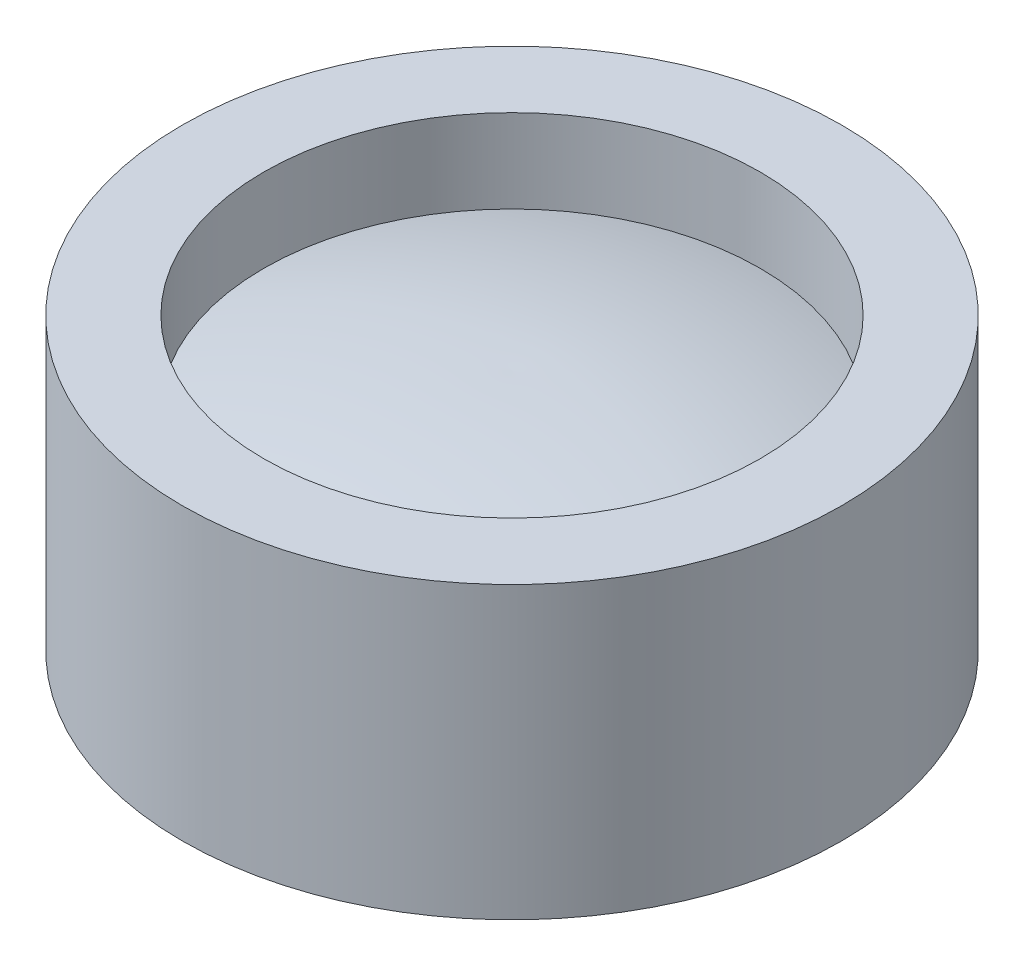
ISO-10303-21;
HEADER;
FILE_DESCRIPTION(('STEP AP214'),'2;1');
FILE_NAME('part.step','',(''),(''),'','','');
FILE_SCHEMA(('AUTOMOTIVE_DESIGN { 1 0 10303 214 1 1 1 1 }'));
ENDSEC;
DATA;
#1=APPLICATION_CONTEXT('core data for automotive mechanical design processes');
#2=APPLICATION_PROTOCOL_DEFINITION('international standard','automotive_design',2000,#1);
#3=PRODUCT_CONTEXT('',#1,'mechanical');
#4=PRODUCT('Part','Part','',(#3));
#5=PRODUCT_RELATED_PRODUCT_CATEGORY('part','',(#4));
#6=PRODUCT_DEFINITION_FORMATION('','',#4);
#7=PRODUCT_DEFINITION_CONTEXT('part definition',#1,'design');
#8=PRODUCT_DEFINITION('design','',#6,#7);
#9=PRODUCT_DEFINITION_SHAPE('','',#8);
#10=(LENGTH_UNIT() NAMED_UNIT(*) SI_UNIT(.MILLI.,.METRE.));
#11=(NAMED_UNIT(*) PLANE_ANGLE_UNIT() SI_UNIT($,.RADIAN.));
#12=(NAMED_UNIT(*) SI_UNIT($,.STERADIAN.) SOLID_ANGLE_UNIT());
#13=UNCERTAINTY_MEASURE_WITH_UNIT(LENGTH_MEASURE(1.E-05),#10,'distance_accuracy_value','');
#14=(GEOMETRIC_REPRESENTATION_CONTEXT(3) GLOBAL_UNCERTAINTY_ASSIGNED_CONTEXT((#13)) GLOBAL_UNIT_ASSIGNED_CONTEXT((#10,
#11,#12)) REPRESENTATION_CONTEXT('',''));
#15=CARTESIAN_POINT('',(0.,0.,0.));
#16=DIRECTION('',(0.,0.,1.));
#17=DIRECTION('',(1.,0.,0.));
#18=AXIS2_PLACEMENT_3D('',#15,#16,#17);
#19=CARTESIAN_POINT('',(1.83,1.32501273648649,0.));
#20=CARTESIAN_POINT('',(0.931309896276939,1.60636738092569,0.));
#21=CARTESIAN_POINT('',(0.,1.59,0.));
#22=B_SPLINE_CURVE_WITH_KNOTS('',2,(#19,#20,#21),.UNSPECIFIED.,.F.,.F.,(3,3),(0.,1.),.UNSPECIFIED.);
#23=CARTESIAN_POINT('',(0.,0.,0.));
#24=DIRECTION('',(0.,-1.,0.));
#25=AXIS1_PLACEMENT('',#23,#24);
#26=SURFACE_OF_REVOLUTION('',#22,#25);
#27=CARTESIAN_POINT('',(0.,1.59,0.));
#28=VERTEX_POINT('',#27);
#29=VERTEX_LOOP('',#28);
#30=FACE_BOUND('',#29,.T.);
#31=CARTESIAN_POINT('',(0.,1.32501273648649,0.));
#32=DIRECTION('',(0.,-1.,0.));
#33=DIRECTION('',(0.,0.,-1.));
#34=AXIS2_PLACEMENT_3D('',#31,#32,#33);
#35=CIRCLE('',#34,1.83);
#36=CARTESIAN_POINT('',(0.,1.32501273648649,-1.83));
#37=VERTEX_POINT('',#36);
#38=EDGE_CURVE('E11',#37,#37,#35,.T.);
#39=ORIENTED_EDGE('',*,*,#38,.F.);
#40=EDGE_LOOP('',(#39));
#41=FACE_BOUND('',#40,.T.);
#42=ADVANCED_FACE('F32',(#30,#41),#26,.F.);
#43=CARTESIAN_POINT('',(0.,0.,0.));
#44=DIRECTION('',(0.,-1.,0.));
#45=DIRECTION('',(0.,0.,-1.));
#46=AXIS2_PLACEMENT_3D('',#43,#44,#45);
#47=CYLINDRICAL_SURFACE('',#46,1.83);
#48=ORIENTED_EDGE('',*,*,#38,.T.);
#49=EDGE_LOOP('',(#48));
#50=FACE_BOUND('',#49,.T.);
#51=CARTESIAN_POINT('',(0.,1.94,0.));
#52=DIRECTION('',(0.,-1.,0.));
#53=DIRECTION('',(0.,0.,-1.));
#54=AXIS2_PLACEMENT_3D('',#51,#52,#53);
#55=CIRCLE('',#54,1.83);
#56=CARTESIAN_POINT('',(0.,1.94,-1.83));
#57=VERTEX_POINT('',#56);
#58=EDGE_CURVE('E39',#57,#57,#55,.T.);
#59=ORIENTED_EDGE('',*,*,#58,.F.);
#60=EDGE_LOOP('',(#59));
#61=FACE_BOUND('',#60,.T.);
#62=ADVANCED_FACE('F44',(#50,#61),#47,.F.);
#63=CARTESIAN_POINT('',(2.43,1.94,0.));
#64=DIRECTION('',(0.,1.,0.));
#65=DIRECTION('',(0.,0.,1.));
#66=AXIS2_PLACEMENT_3D('',#63,#64,#65);
#67=PLANE('',#66);
#68=ORIENTED_EDGE('',*,*,#58,.T.);
#69=EDGE_LOOP('',(#68));
#70=FACE_BOUND('',#69,.T.);
#71=CARTESIAN_POINT('',(0.,1.94,0.));
#72=DIRECTION('',(0.,-1.,0.));
#73=DIRECTION('',(0.,0.,-1.));
#74=AXIS2_PLACEMENT_3D('',#71,#72,#73);
#75=CIRCLE('',#74,2.43);
#76=CARTESIAN_POINT('',(0.,1.94,-2.43));
#77=VERTEX_POINT('',#76);
#78=EDGE_CURVE('E53',#77,#77,#75,.T.);
#79=ORIENTED_EDGE('',*,*,#78,.F.);
#80=EDGE_LOOP('',(#79));
#81=FACE_BOUND('',#80,.T.);
#82=ADVANCED_FACE('F49',(#70,#81),#67,.T.);
#83=CARTESIAN_POINT('',(0.,0.,0.));
#84=DIRECTION('',(0.,-1.,0.));
#85=DIRECTION('',(0.,0.,-1.));
#86=AXIS2_PLACEMENT_3D('',#83,#84,#85);
#87=CYLINDRICAL_SURFACE('',#86,2.43);
#88=ORIENTED_EDGE('',*,*,#78,.T.);
#89=EDGE_LOOP('',(#88));
#90=FACE_BOUND('',#89,.T.);
#91=CARTESIAN_POINT('',(0.,-0.2,0.));
#92=DIRECTION('',(0.,-1.,0.));
#93=DIRECTION('',(0.,0.,-1.));
#94=AXIS2_PLACEMENT_3D('',#91,#92,#93);
#95=CIRCLE('',#94,2.43);
#96=CARTESIAN_POINT('',(0.,-0.2,-2.43));
#97=VERTEX_POINT('',#96);
#98=EDGE_CURVE('E55',#97,#97,#95,.T.);
#99=ORIENTED_EDGE('',*,*,#98,.F.);
#100=EDGE_LOOP('',(#99));
#101=FACE_BOUND('',#100,.T.);
#102=ADVANCED_FACE('F85',(#90,#101),#87,.T.);
#103=CARTESIAN_POINT('',(1.88,-0.2,0.));
#104=DIRECTION('',(0.,-1.,0.));
#105=DIRECTION('',(0.,0.,-1.));
#106=AXIS2_PLACEMENT_3D('',#103,#104,#105);
#107=PLANE('',#106);
#108=ORIENTED_EDGE('',*,*,#98,.T.);
#109=EDGE_LOOP('',(#108));
#110=FACE_BOUND('',#109,.T.);
#111=CARTESIAN_POINT('',(0.,-0.2,0.));
#112=DIRECTION('',(0.,-1.,0.));
#113=DIRECTION('',(0.,0.,-1.));
#114=AXIS2_PLACEMENT_3D('',#111,#112,#113);
#115=CIRCLE('',#114,1.88);
#116=CARTESIAN_POINT('',(0.,-0.2,-1.88));
#117=VERTEX_POINT('',#116);
#118=EDGE_CURVE('E60',#117,#117,#115,.T.);
#119=ORIENTED_EDGE('',*,*,#118,.F.);
#120=EDGE_LOOP('',(#119));
#121=FACE_BOUND('',#120,.T.);
#122=ADVANCED_FACE('F77',(#110,#121),#107,.T.);
#123=CARTESIAN_POINT('',(0.,0.,0.));
#124=DIRECTION('',(0.,-1.,0.));
#125=DIRECTION('',(0.,0.,-1.));
#126=AXIS2_PLACEMENT_3D('',#123,#124,#125);
#127=CYLINDRICAL_SURFACE('',#126,1.88);
#128=ORIENTED_EDGE('',*,*,#118,.T.);
#129=EDGE_LOOP('',(#128));
#130=FACE_BOUND('',#129,.T.);
#131=CARTESIAN_POINT('',(0.,0.,0.));
#132=DIRECTION('',(0.,-1.,0.));
#133=DIRECTION('',(0.,0.,-1.));
#134=AXIS2_PLACEMENT_3D('',#131,#132,#133);
#135=CIRCLE('',#134,1.88);
#136=CARTESIAN_POINT('',(0.,0.,-1.88));
#137=VERTEX_POINT('',#136);
#138=EDGE_CURVE('E63',#137,#137,#135,.T.);
#139=ORIENTED_EDGE('',*,*,#138,.F.);
#140=EDGE_LOOP('',(#139));
#141=FACE_BOUND('',#140,.T.);
#142=ADVANCED_FACE('F75',(#130,#141),#127,.F.);
#143=CARTESIAN_POINT('',(0.,0.,0.));
#144=DIRECTION('',(0.,-1.,0.));
#145=DIRECTION('',(0.,0.,-1.));
#146=AXIS2_PLACEMENT_3D('',#143,#144,#145);
#147=PLANE('',#146);
#148=ORIENTED_EDGE('',*,*,#138,.T.);
#149=EDGE_LOOP('',(#148));
#150=FACE_BOUND('',#149,.T.);
#151=ADVANCED_FACE('F73',(#150),#147,.T.);
#152=CLOSED_SHELL('',(#42,#62,#82,#102,#122,#142,#151));
#153=MANIFOLD_SOLID_BREP('B2',#152);
#154=ADVANCED_BREP_SHAPE_REPRESENTATION('',(#18,#153),#14);
#155=SHAPE_DEFINITION_REPRESENTATION(#9,#154);
ENDSEC;
END-ISO-10303-21;
